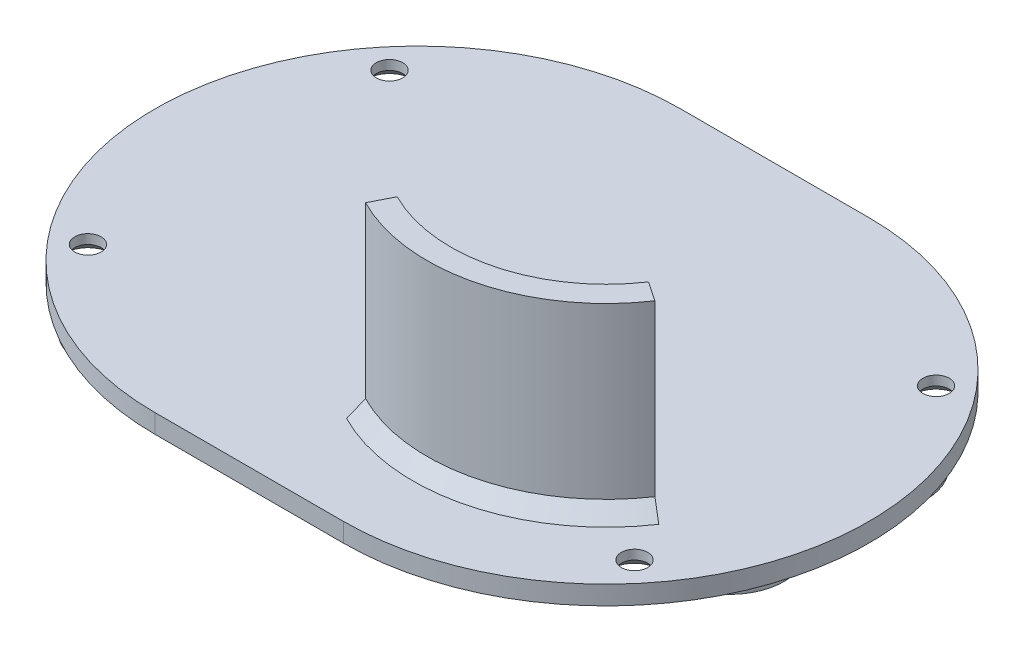
ISO-10303-21;
HEADER;
FILE_DESCRIPTION(('STEP AP214'),'2;1');
FILE_NAME('part.step','',(''),(''),'','','');
FILE_SCHEMA(('AUTOMOTIVE_DESIGN { 1 0 10303 214 1 1 1 1 }'));
ENDSEC;
DATA;
#1=APPLICATION_CONTEXT('core data for automotive mechanical design processes');
#2=APPLICATION_PROTOCOL_DEFINITION('international standard','automotive_design',2000,#1);
#3=PRODUCT_CONTEXT('',#1,'mechanical');
#4=PRODUCT('Part','Part','',(#3));
#5=PRODUCT_RELATED_PRODUCT_CATEGORY('part','',(#4));
#6=PRODUCT_DEFINITION_FORMATION('','',#4);
#7=PRODUCT_DEFINITION_CONTEXT('part definition',#1,'design');
#8=PRODUCT_DEFINITION('design','',#6,#7);
#9=PRODUCT_DEFINITION_SHAPE('','',#8);
#10=(LENGTH_UNIT() NAMED_UNIT(*) SI_UNIT(.MILLI.,.METRE.));
#11=(NAMED_UNIT(*) PLANE_ANGLE_UNIT() SI_UNIT($,.RADIAN.));
#12=(NAMED_UNIT(*) SI_UNIT($,.STERADIAN.) SOLID_ANGLE_UNIT());
#13=UNCERTAINTY_MEASURE_WITH_UNIT(LENGTH_MEASURE(1.E-05),#10,'distance_accuracy_value','');
#14=(GEOMETRIC_REPRESENTATION_CONTEXT(3) GLOBAL_UNCERTAINTY_ASSIGNED_CONTEXT((#13)) GLOBAL_UNIT_ASSIGNED_CONTEXT((#10,
#11,#12)) REPRESENTATION_CONTEXT('',''));
#15=CARTESIAN_POINT('',(0.,0.,0.));
#16=DIRECTION('',(0.,0.,1.));
#17=DIRECTION('',(1.,0.,0.));
#18=AXIS2_PLACEMENT_3D('',#15,#16,#17);
#19=CARTESIAN_POINT('',(0.,2.,0.));
#20=DIRECTION('',(0.,-1.,0.));
#21=DIRECTION('',(0.,0.,-1.));
#22=AXIS2_PLACEMENT_3D('',#19,#20,#21);
#23=PLANE('',#22);
#24=CARTESIAN_POINT('',(39.,2.,-16.));
#25=DIRECTION('',(0.,-1.,0.));
#26=DIRECTION('',(0.,0.,-1.));
#27=AXIS2_PLACEMENT_3D('',#24,#25,#26);
#28=CIRCLE('',#27,1.4);
#29=CARTESIAN_POINT('',(39.,2.,-17.4));
#30=VERTEX_POINT('',#29);
#31=EDGE_CURVE('E237',#30,#30,#28,.T.);
#32=ORIENTED_EDGE('',*,*,#31,.T.);
#33=EDGE_LOOP('',(#32));
#34=FACE_BOUND('',#33,.T.);
#35=CARTESIAN_POINT('',(39.,2.,16.));
#36=DIRECTION('',(0.,-1.,0.));
#37=DIRECTION('',(0.,0.,-1.));
#38=AXIS2_PLACEMENT_3D('',#35,#36,#37);
#39=CIRCLE('',#38,1.4);
#40=CARTESIAN_POINT('',(39.,2.,14.6));
#41=VERTEX_POINT('',#40);
#42=EDGE_CURVE('E232',#41,#41,#39,.T.);
#43=ORIENTED_EDGE('',*,*,#42,.T.);
#44=EDGE_LOOP('',(#43));
#45=FACE_BOUND('',#44,.T.);
#46=CARTESIAN_POINT('',(-19.,2.,16.));
#47=DIRECTION('',(0.,-1.,0.));
#48=DIRECTION('',(0.,0.,-1.));
#49=AXIS2_PLACEMENT_3D('',#46,#47,#48);
#50=CIRCLE('',#49,1.4);
#51=CARTESIAN_POINT('',(-19.,2.,14.6));
#52=VERTEX_POINT('',#51);
#53=EDGE_CURVE('E227',#52,#52,#50,.T.);
#54=ORIENTED_EDGE('',*,*,#53,.T.);
#55=EDGE_LOOP('',(#54));
#56=FACE_BOUND('',#55,.T.);
#57=CARTESIAN_POINT('',(-19.,2.,-16.));
#58=DIRECTION('',(0.,-1.,0.));
#59=DIRECTION('',(0.,0.,-1.));
#60=AXIS2_PLACEMENT_3D('',#57,#58,#59);
#61=CIRCLE('',#60,1.4);
#62=CARTESIAN_POINT('',(-19.,2.,-17.4));
#63=VERTEX_POINT('',#62);
#64=EDGE_CURVE('E171',#63,#63,#61,.T.);
#65=ORIENTED_EDGE('',*,*,#64,.T.);
#66=EDGE_LOOP('',(#65));
#67=FACE_BOUND('',#66,.T.);
#68=CARTESIAN_POINT('',(0.,2.,0.));
#69=DIRECTION('',(0.,-1.,0.));
#70=DIRECTION('',(0.,0.,-1.));
#71=AXIS2_PLACEMENT_3D('',#68,#69,#70);
#72=CIRCLE('',#71,27.9);
#73=CARTESIAN_POINT('',(0.,2.,27.9));
#74=VERTEX_POINT('',#73);
#75=CARTESIAN_POINT('',(0.,2.,-27.9));
#76=VERTEX_POINT('',#75);
#77=EDGE_CURVE('E157',#74,#76,#72,.T.);
#78=ORIENTED_EDGE('',*,*,#77,.F.);
#79=DIRECTION('',(-1.,0.,0.));
#80=VECTOR('',#79,1.);
#81=CARTESIAN_POINT('',(20.,2.,27.9));
#82=LINE('',#81,#80);
#83=CARTESIAN_POINT('',(20.,2.,27.9));
#84=VERTEX_POINT('',#83);
#85=EDGE_CURVE('E182',#84,#74,#82,.T.);
#86=ORIENTED_EDGE('',*,*,#85,.F.);
#87=CARTESIAN_POINT('',(20.,2.,0.));
#88=DIRECTION('',(0.,-1.,0.));
#89=DIRECTION('',(0.,0.,-1.));
#90=AXIS2_PLACEMENT_3D('',#87,#88,#89);
#91=CIRCLE('',#90,27.9);
#92=CARTESIAN_POINT('',(20.,2.,-27.9));
#93=VERTEX_POINT('',#92);
#94=EDGE_CURVE('E193',#93,#84,#91,.T.);
#95=ORIENTED_EDGE('',*,*,#94,.F.);
#96=DIRECTION('',(1.,0.,0.));
#97=VECTOR('',#96,1.);
#98=CARTESIAN_POINT('',(0.,2.,-27.9));
#99=LINE('',#98,#97);
#100=EDGE_CURVE('E191',#76,#93,#99,.T.);
#101=ORIENTED_EDGE('',*,*,#100,.F.);
#102=EDGE_LOOP('',(#78,#86,#95,#101));
#103=FACE_BOUND('',#102,.T.);
#104=CARTESIAN_POINT('',(20.,2.,0.));
#105=DIRECTION('',(0.,-1.,0.));
#106=DIRECTION('',(0.,0.,-1.));
#107=AXIS2_PLACEMENT_3D('',#104,#105,#106);
#108=CIRCLE('',#107,20.5);
#109=CARTESIAN_POINT('',(37.0125523501253,2.,11.4377909814023));
#110=VERTEX_POINT('',#109);
#111=CARTESIAN_POINT('',(10.7221709660309,2.,18.2803689354575));
#112=VERTEX_POINT('',#111);
#113=EDGE_CURVE('E210',#110,#112,#108,.T.);
#114=ORIENTED_EDGE('',*,*,#113,.T.);
#115=DIRECTION('',(0.452577026047278,0.,-0.891725313924754));
#116=VECTOR('',#115,1.);
#117=CARTESIAN_POINT('',(11.4010365051018,2.,16.9427809645704));
#118=LINE('',#117,#116);
#119=CARTESIAN_POINT('',(13.2113446092909,2.,13.3758797088713));
#120=VERTEX_POINT('',#119);
#121=EDGE_CURVE('E169',#112,#120,#118,.T.);
#122=ORIENTED_EDGE('',*,*,#121,.T.);
#123=CARTESIAN_POINT('',(20.,2.,0.));
#124=DIRECTION('',(0.,-1.,0.));
#125=DIRECTION('',(0.,0.,-1.));
#126=AXIS2_PLACEMENT_3D('',#123,#124,#125);
#127=CIRCLE('',#126,15.);
#128=CARTESIAN_POINT('',(32.448209036677,2.,8.36911535224557));
#129=VERTEX_POINT('',#128);
#130=EDGE_CURVE('E207',#120,#129,#127,.F.);
#131=ORIENTED_EDGE('',*,*,#130,.T.);
#132=DIRECTION('',(0.829880602445134,0.,0.557941023483039));
#133=VECTOR('',#132,1.);
#134=CARTESIAN_POINT('',(33.6930299403447,2.,9.20602688747011));
#135=LINE('',#134,#133);
#136=EDGE_CURVE('E150',#129,#110,#135,.T.);
#137=ORIENTED_EDGE('',*,*,#136,.T.);
#138=EDGE_LOOP('',(#114,#122,#131,#137));
#139=FACE_BOUND('',#138,.T.);
#140=ADVANCED_FACE('F59',(#34,#45,#56,#67,#103,#139),#23,.F.);
#141=CARTESIAN_POINT('',(0.,0.,0.));
#142=DIRECTION('',(0.,1.,0.));
#143=DIRECTION('',(0.,0.,1.));
#144=AXIS2_PLACEMENT_3D('',#141,#142,#143);
#145=CYLINDRICAL_SURFACE('',#144,27.9);
#146=ORIENTED_EDGE('',*,*,#77,.T.);
#147=DIRECTION('',(0.,1.,0.));
#148=VECTOR('',#147,1.);
#149=CARTESIAN_POINT('',(0.,0.,-27.9));
#150=LINE('',#149,#148);
#151=CARTESIAN_POINT('',(0.,0.,-27.9));
#152=VERTEX_POINT('',#151);
#153=EDGE_CURVE('E204',#152,#76,#150,.T.);
#154=ORIENTED_EDGE('',*,*,#153,.F.);
#155=CARTESIAN_POINT('',(0.,0.,0.));
#156=DIRECTION('',(0.,-1.,0.));
#157=DIRECTION('',(0.,0.,-1.));
#158=AXIS2_PLACEMENT_3D('',#155,#156,#157);
#159=CIRCLE('',#158,27.9);
#160=CARTESIAN_POINT('',(0.,0.,27.9));
#161=VERTEX_POINT('',#160);
#162=EDGE_CURVE('E178',#161,#152,#159,.T.);
#163=ORIENTED_EDGE('',*,*,#162,.F.);
#164=DIRECTION('',(0.,1.,0.));
#165=VECTOR('',#164,1.);
#166=CARTESIAN_POINT('',(0.,0.,27.9));
#167=LINE('',#166,#165);
#168=EDGE_CURVE('E188',#161,#74,#167,.T.);
#169=ORIENTED_EDGE('',*,*,#168,.T.);
#170=EDGE_LOOP('',(#146,#154,#163,#169));
#171=FACE_BOUND('',#170,.T.);
#172=ADVANCED_FACE('F279',(#171),#145,.T.);
#173=CARTESIAN_POINT('',(0.,0.,-27.9));
#174=DIRECTION('',(0.,0.,1.));
#175=DIRECTION('',(1.,0.,0.));
#176=AXIS2_PLACEMENT_3D('',#173,#174,#175);
#177=PLANE('',#176);
#178=ORIENTED_EDGE('',*,*,#100,.T.);
#179=DIRECTION('',(0.,1.,0.));
#180=VECTOR('',#179,1.);
#181=CARTESIAN_POINT('',(20.,0.,-27.9));
#182=LINE('',#181,#180);
#183=CARTESIAN_POINT('',(20.,0.,-27.9));
#184=VERTEX_POINT('',#183);
#185=EDGE_CURVE('E201',#184,#93,#182,.T.);
#186=ORIENTED_EDGE('',*,*,#185,.F.);
#187=DIRECTION('',(1.,0.,0.));
#188=VECTOR('',#187,1.);
#189=CARTESIAN_POINT('',(0.,0.,-27.9));
#190=LINE('',#189,#188);
#191=EDGE_CURVE('E181',#152,#184,#190,.T.);
#192=ORIENTED_EDGE('',*,*,#191,.F.);
#193=ORIENTED_EDGE('',*,*,#153,.T.);
#194=EDGE_LOOP('',(#178,#186,#192,#193));
#195=FACE_BOUND('',#194,.T.);
#196=ADVANCED_FACE('F284',(#195),#177,.F.);
#197=CARTESIAN_POINT('',(20.,0.,0.));
#198=DIRECTION('',(0.,1.,0.));
#199=DIRECTION('',(0.,0.,1.));
#200=AXIS2_PLACEMENT_3D('',#197,#198,#199);
#201=CYLINDRICAL_SURFACE('',#200,27.9);
#202=ORIENTED_EDGE('',*,*,#94,.T.);
#203=DIRECTION('',(0.,1.,0.));
#204=VECTOR('',#203,1.);
#205=CARTESIAN_POINT('',(20.,0.,27.9));
#206=LINE('',#205,#204);
#207=CARTESIAN_POINT('',(20.,0.,27.9));
#208=VERTEX_POINT('',#207);
#209=EDGE_CURVE('E198',#208,#84,#206,.T.);
#210=ORIENTED_EDGE('',*,*,#209,.F.);
#211=CARTESIAN_POINT('',(20.,0.,0.));
#212=DIRECTION('',(0.,-1.,0.));
#213=DIRECTION('',(0.,0.,-1.));
#214=AXIS2_PLACEMENT_3D('',#211,#212,#213);
#215=CIRCLE('',#214,27.9);
#216=EDGE_CURVE('E184',#184,#208,#215,.T.);
#217=ORIENTED_EDGE('',*,*,#216,.F.);
#218=ORIENTED_EDGE('',*,*,#185,.T.);
#219=EDGE_LOOP('',(#202,#210,#217,#218));
#220=FACE_BOUND('',#219,.T.);
#221=ADVANCED_FACE('F292',(#220),#201,.T.);
#222=CARTESIAN_POINT('',(20.,0.,27.9));
#223=DIRECTION('',(0.,0.,-1.));
#224=DIRECTION('',(-1.,0.,0.));
#225=AXIS2_PLACEMENT_3D('',#222,#223,#224);
#226=PLANE('',#225);
#227=ORIENTED_EDGE('',*,*,#85,.T.);
#228=ORIENTED_EDGE('',*,*,#168,.F.);
#229=DIRECTION('',(-1.,0.,0.));
#230=VECTOR('',#229,1.);
#231=CARTESIAN_POINT('',(20.,0.,27.9));
#232=LINE('',#231,#230);
#233=EDGE_CURVE('E186',#208,#161,#232,.T.);
#234=ORIENTED_EDGE('',*,*,#233,.F.);
#235=ORIENTED_EDGE('',*,*,#209,.T.);
#236=EDGE_LOOP('',(#227,#228,#234,#235));
#237=FACE_BOUND('',#236,.T.);
#238=ADVANCED_FACE('F289',(#237),#226,.F.);
#239=CARTESIAN_POINT('',(0.,0.,0.));
#240=DIRECTION('',(0.,-1.,0.));
#241=DIRECTION('',(0.,0.,-1.));
#242=AXIS2_PLACEMENT_3D('',#239,#240,#241);
#243=PLANE('',#242);
#244=CARTESIAN_POINT('',(40.67323765729,0.,-7.52444315316458));
#245=DIRECTION('',(0.,-1.,0.));
#246=DIRECTION('',(1.,0.,0.));
#247=AXIS2_PLACEMENT_3D('',#244,#245,#246);
#248=CIRCLE('',#247,5.75000000000001);
#249=CARTESIAN_POINT('',(46.42323765729,0.,-7.52444315316458));
#250=VERTEX_POINT('',#249);
#251=EDGE_CURVE('E456',#250,#250,#248,.T.);
#252=ORIENTED_EDGE('',*,*,#251,.F.);
#253=EDGE_LOOP('',(#252));
#254=FACE_BOUND('',#253,.T.);
#255=CARTESIAN_POINT('',(40.67323765729,0.,7.52444315316458));
#256=DIRECTION('',(0.,-1.,0.));
#257=DIRECTION('',(1.,0.,0.));
#258=AXIS2_PLACEMENT_3D('',#255,#256,#257);
#259=CIRCLE('',#258,5.75000000000001);
#260=CARTESIAN_POINT('',(46.42323765729,0.,7.52444315316458));
#261=VERTEX_POINT('',#260);
#262=EDGE_CURVE('E447',#261,#261,#259,.T.);
#263=ORIENTED_EDGE('',*,*,#262,.F.);
#264=EDGE_LOOP('',(#263));
#265=FACE_BOUND('',#264,.T.);
#266=CARTESIAN_POINT('',(-11.,0.,-19.0525588832577));
#267=DIRECTION('',(0.,-1.,0.));
#268=DIRECTION('',(1.,0.,0.));
#269=AXIS2_PLACEMENT_3D('',#266,#267,#268);
#270=CIRCLE('',#269,5.75);
#271=CARTESIAN_POINT('',(-5.24999999999995,0.,-19.0525588832577));
#272=VERTEX_POINT('',#271);
#273=EDGE_CURVE('E438',#272,#272,#270,.T.);
#274=ORIENTED_EDGE('',*,*,#273,.F.);
#275=EDGE_LOOP('',(#274));
#276=FACE_BOUND('',#275,.T.);
#277=CARTESIAN_POINT('',(-11.,0.,19.0525588832577));
#278=DIRECTION('',(0.,-1.,0.));
#279=DIRECTION('',(1.,0.,0.));
#280=AXIS2_PLACEMENT_3D('',#277,#278,#279);
#281=CIRCLE('',#280,5.75);
#282=CARTESIAN_POINT('',(-5.24999999999995,0.,19.0525588832577));
#283=VERTEX_POINT('',#282);
#284=EDGE_CURVE('E430',#283,#283,#281,.T.);
#285=ORIENTED_EDGE('',*,*,#284,.F.);
#286=EDGE_LOOP('',(#285));
#287=FACE_BOUND('',#286,.T.);
#288=CARTESIAN_POINT('',(39.,0.,-16.));
#289=DIRECTION('',(0.,-1.,0.));
#290=DIRECTION('',(0.,0.,-1.));
#291=AXIS2_PLACEMENT_3D('',#288,#289,#290);
#292=CIRCLE('',#291,2.4);
#293=CARTESIAN_POINT('',(39.,0.,-18.4));
#294=VERTEX_POINT('',#293);
#295=EDGE_CURVE('E426',#294,#294,#292,.T.);
#296=ORIENTED_EDGE('',*,*,#295,.F.);
#297=EDGE_LOOP('',(#296));
#298=FACE_BOUND('',#297,.T.);
#299=CARTESIAN_POINT('',(39.,0.,16.));
#300=DIRECTION('',(0.,-1.,0.));
#301=DIRECTION('',(0.,0.,-1.));
#302=AXIS2_PLACEMENT_3D('',#299,#300,#301);
#303=CIRCLE('',#302,2.4);
#304=CARTESIAN_POINT('',(39.,0.,13.6));
#305=VERTEX_POINT('',#304);
#306=EDGE_CURVE('E240',#305,#305,#303,.T.);
#307=ORIENTED_EDGE('',*,*,#306,.F.);
#308=EDGE_LOOP('',(#307));
#309=FACE_BOUND('',#308,.T.);
#310=CARTESIAN_POINT('',(-19.,0.,16.));
#311=DIRECTION('',(0.,-1.,0.));
#312=DIRECTION('',(0.,0.,-1.));
#313=AXIS2_PLACEMENT_3D('',#310,#311,#312);
#314=CIRCLE('',#313,2.4);
#315=CARTESIAN_POINT('',(-19.,0.,13.6));
#316=VERTEX_POINT('',#315);
#317=EDGE_CURVE('E235',#316,#316,#314,.T.);
#318=ORIENTED_EDGE('',*,*,#317,.F.);
#319=EDGE_LOOP('',(#318));
#320=FACE_BOUND('',#319,.T.);
#321=CARTESIAN_POINT('',(-19.,0.,-16.));
#322=DIRECTION('',(0.,-1.,0.));
#323=DIRECTION('',(0.,0.,-1.));
#324=AXIS2_PLACEMENT_3D('',#321,#322,#323);
#325=CIRCLE('',#324,2.4);
#326=CARTESIAN_POINT('',(-19.,0.,-18.4));
#327=VERTEX_POINT('',#326);
#328=EDGE_CURVE('E230',#327,#327,#325,.T.);
#329=ORIENTED_EDGE('',*,*,#328,.F.);
#330=EDGE_LOOP('',(#329));
#331=FACE_BOUND('',#330,.T.);
#332=ORIENTED_EDGE('',*,*,#162,.T.);
#333=ORIENTED_EDGE('',*,*,#191,.T.);
#334=ORIENTED_EDGE('',*,*,#216,.T.);
#335=ORIENTED_EDGE('',*,*,#233,.T.);
#336=EDGE_LOOP('',(#332,#333,#334,#335));
#337=FACE_BOUND('',#336,.T.);
#338=ADVANCED_FACE('F267',(#254,#265,#276,#287,#298,#309,#320,#331,#337),#243,.T.);
#339=CARTESIAN_POINT('',(20.,21.5,0.));
#340=DIRECTION('',(0.,-1.,0.));
#341=DIRECTION('',(0.,0.,-1.));
#342=AXIS2_PLACEMENT_3D('',#339,#340,#341);
#343=CYLINDRICAL_SURFACE('',#342,16.5);
#344=DIRECTION('',(0.,-1.,0.));
#345=VECTOR('',#344,1.);
#346=CARTESIAN_POINT('',(33.6930299403447,21.5,9.20602688747011));
#347=LINE('',#346,#345);
#348=CARTESIAN_POINT('',(33.6930299403447,21.5,9.20602688747011));
#349=VERTEX_POINT('',#348);
#350=CARTESIAN_POINT('',(33.6930299403447,3.50000000000001,9.20602688747011));
#351=VERTEX_POINT('',#350);
#352=EDGE_CURVE('E168',#349,#351,#347,.T.);
#353=ORIENTED_EDGE('',*,*,#352,.T.);
#354=CARTESIAN_POINT('',(20.,3.50000000000001,0.));
#355=DIRECTION('',(0.,-1.,0.));
#356=DIRECTION('',(0.,0.,-1.));
#357=AXIS2_PLACEMENT_3D('',#354,#355,#356);
#358=CIRCLE('',#357,16.5);
#359=CARTESIAN_POINT('',(12.53247907022,3.50000000000001,14.7134676797585));
#360=VERTEX_POINT('',#359);
#361=EDGE_CURVE('E155',#351,#360,#358,.T.);
#362=ORIENTED_EDGE('',*,*,#361,.T.);
#363=DIRECTION('',(0.,-1.,0.));
#364=VECTOR('',#363,1.);
#365=CARTESIAN_POINT('',(12.53247907022,21.5,14.7134676797585));
#366=LINE('',#365,#364);
#367=CARTESIAN_POINT('',(12.53247907022,21.5,14.7134676797585));
#368=VERTEX_POINT('',#367);
#369=EDGE_CURVE('E153',#368,#360,#366,.T.);
#370=ORIENTED_EDGE('',*,*,#369,.F.);
#371=CARTESIAN_POINT('',(20.,21.5,0.));
#372=DIRECTION('',(0.,-1.,0.));
#373=DIRECTION('',(0.,0.,-1.));
#374=AXIS2_PLACEMENT_3D('',#371,#372,#373);
#375=CIRCLE('',#374,16.5);
#376=EDGE_CURVE('E140',#349,#368,#375,.T.);
#377=ORIENTED_EDGE('',*,*,#376,.F.);
#378=EDGE_LOOP('',(#353,#362,#370,#377));
#379=FACE_BOUND('',#378,.T.);
#380=ADVANCED_FACE('F154',(#379),#343,.F.);
#381=CARTESIAN_POINT('',(11.4010365051018,21.5,16.9427809645704));
#382=DIRECTION('',(-0.891725313924754,0.,-0.452577026047278));
#383=DIRECTION('',(-0.452577026047278,0.,0.891725313924754));
#384=AXIS2_PLACEMENT_3D('',#381,#382,#383);
#385=PLANE('',#384);
#386=ORIENTED_EDGE('',*,*,#121,.F.);
#387=DIRECTION('',(0.320020284127271,0.707106781186547,-0.630545016431897));
#388=VECTOR('',#387,1.);
#389=CARTESIAN_POINT('',(20.,22.4999999999999,0.));
#390=LINE('',#389,#388);
#391=CARTESIAN_POINT('',(11.4010365051018,3.49999999999998,16.9427809645704));
#392=VERTEX_POINT('',#391);
#393=EDGE_CURVE('E216',#112,#392,#390,.T.);
#394=ORIENTED_EDGE('',*,*,#393,.T.);
#395=DIRECTION('',(0.,-1.,0.));
#396=VECTOR('',#395,1.);
#397=CARTESIAN_POINT('',(11.4010365051018,21.5,16.9427809645704));
#398=LINE('',#397,#396);
#399=CARTESIAN_POINT('',(11.4010365051018,21.5,16.9427809645704));
#400=VERTEX_POINT('',#399);
#401=EDGE_CURVE('E158',#400,#392,#398,.T.);
#402=ORIENTED_EDGE('',*,*,#401,.F.);
#403=DIRECTION('',(0.452577026047278,0.,-0.891725313924754));
#404=VECTOR('',#403,1.);
#405=CARTESIAN_POINT('',(11.4010365051018,21.5,16.9427809645704));
#406=LINE('',#405,#404);
#407=EDGE_CURVE('E145',#400,#368,#406,.T.);
#408=ORIENTED_EDGE('',*,*,#407,.T.);
#409=ORIENTED_EDGE('',*,*,#369,.T.);
#410=DIRECTION('',(-0.320020284127269,0.707106781186551,0.630545016431894));
#411=VECTOR('',#410,1.);
#412=CARTESIAN_POINT('',(20.,-13.0000000000002,0.));
#413=LINE('',#412,#411);
#414=EDGE_CURVE('E83',#360,#120,#413,.F.);
#415=ORIENTED_EDGE('',*,*,#414,.T.);
#416=EDGE_LOOP('',(#386,#394,#402,#408,#409,#415));
#417=FACE_BOUND('',#416,.T.);
#418=ADVANCED_FACE('F160',(#417),#385,.T.);
#419=CARTESIAN_POINT('',(20.,21.5,0.));
#420=DIRECTION('',(0.,-1.,0.));
#421=DIRECTION('',(0.,0.,-1.));
#422=AXIS2_PLACEMENT_3D('',#419,#420,#421);
#423=CYLINDRICAL_SURFACE('',#422,19.);
#424=ORIENTED_EDGE('',*,*,#401,.T.);
#425=CARTESIAN_POINT('',(20.,3.49999999999998,0.));
#426=DIRECTION('',(0.,-1.,0.));
#427=DIRECTION('',(0.,0.,-1.));
#428=AXIS2_PLACEMENT_3D('',#425,#426,#427);
#429=CIRCLE('',#428,19.);
#430=CARTESIAN_POINT('',(35.7677314464576,3.49999999999998,10.6008794461777));
#431=VERTEX_POINT('',#430);
#432=EDGE_CURVE('E213',#392,#431,#429,.F.);
#433=ORIENTED_EDGE('',*,*,#432,.T.);
#434=DIRECTION('',(0.,-1.,0.));
#435=VECTOR('',#434,1.);
#436=CARTESIAN_POINT('',(35.7677314464576,21.5,10.6008794461777));
#437=LINE('',#436,#435);
#438=CARTESIAN_POINT('',(35.7677314464576,21.5,10.6008794461777));
#439=VERTEX_POINT('',#438);
#440=EDGE_CURVE('E174',#439,#431,#437,.T.);
#441=ORIENTED_EDGE('',*,*,#440,.F.);
#442=CARTESIAN_POINT('',(20.,21.5,0.));
#443=DIRECTION('',(0.,1.,0.));
#444=DIRECTION('',(1.,0.,0.));
#445=AXIS2_PLACEMENT_3D('',#442,#443,#444);
#446=CIRCLE('',#445,19.);
#447=EDGE_CURVE('E162',#439,#400,#446,.F.);
#448=ORIENTED_EDGE('',*,*,#447,.T.);
#449=EDGE_LOOP('',(#424,#433,#441,#448));
#450=FACE_BOUND('',#449,.T.);
#451=ADVANCED_FACE('F317',(#450),#423,.T.);
#452=CARTESIAN_POINT('',(33.6930299403447,21.5,9.20602688747011));
#453=DIRECTION('',(0.557941023483039,0.,-0.829880602445135));
#454=DIRECTION('',(-0.829880602445135,0.,-0.557941023483039));
#455=AXIS2_PLACEMENT_3D('',#452,#453,#454);
#456=PLANE('',#455);
#457=ORIENTED_EDGE('',*,*,#136,.F.);
#458=DIRECTION('',(-0.586814201564129,-0.707106781186551,-0.394523881207018));
#459=VECTOR('',#458,1.);
#460=CARTESIAN_POINT('',(20.,-13.0000000000002,0.));
#461=LINE('',#460,#459);
#462=EDGE_CURVE('E75',#129,#351,#461,.F.);
#463=ORIENTED_EDGE('',*,*,#462,.T.);
#464=ORIENTED_EDGE('',*,*,#352,.F.);
#465=DIRECTION('',(0.829880602445134,0.,0.557941023483039));
#466=VECTOR('',#465,1.);
#467=CARTESIAN_POINT('',(33.6930299403447,21.5,9.20602688747011));
#468=LINE('',#467,#466);
#469=EDGE_CURVE('E148',#349,#439,#468,.T.);
#470=ORIENTED_EDGE('',*,*,#469,.T.);
#471=ORIENTED_EDGE('',*,*,#440,.T.);
#472=DIRECTION('',(0.586814201564133,-0.707106781186547,0.39452388120702));
#473=VECTOR('',#472,1.);
#474=CARTESIAN_POINT('',(20.,22.4999999999999,0.));
#475=LINE('',#474,#473);
#476=EDGE_CURVE('E218',#431,#110,#475,.T.);
#477=ORIENTED_EDGE('',*,*,#476,.T.);
#478=EDGE_LOOP('',(#457,#463,#464,#470,#471,#477));
#479=FACE_BOUND('',#478,.T.);
#480=ADVANCED_FACE('F310',(#479),#456,.T.);
#481=CARTESIAN_POINT('',(20.,21.5,0.));
#482=DIRECTION('',(0.,-1.,0.));
#483=DIRECTION('',(-1.,0.,0.));
#484=AXIS2_PLACEMENT_3D('',#481,#482,#483);
#485=PLANE('',#484);
#486=ORIENTED_EDGE('',*,*,#376,.T.);
#487=ORIENTED_EDGE('',*,*,#407,.F.);
#488=ORIENTED_EDGE('',*,*,#447,.F.);
#489=ORIENTED_EDGE('',*,*,#469,.F.);
#490=EDGE_LOOP('',(#486,#487,#488,#489));
#491=FACE_BOUND('',#490,.T.);
#492=ADVANCED_FACE('F142',(#491),#485,.F.);
#493=CARTESIAN_POINT('',(20.,2.,0.));
#494=DIRECTION('',(0.,-1.,0.));
#495=DIRECTION('',(0.,0.,-1.));
#496=AXIS2_PLACEMENT_3D('',#493,#494,#495);
#497=CONICAL_SURFACE('',#496,20.5,0.78539816339745);
#498=ORIENTED_EDGE('',*,*,#476,.F.);
#499=ORIENTED_EDGE('',*,*,#432,.F.);
#500=ORIENTED_EDGE('',*,*,#393,.F.);
#501=ORIENTED_EDGE('',*,*,#113,.F.);
#502=EDGE_LOOP('',(#498,#499,#500,#501));
#503=FACE_BOUND('',#502,.T.);
#504=ADVANCED_FACE('F300',(#503),#497,.T.);
#505=CARTESIAN_POINT('',(20.,3.50000000000001,0.));
#506=DIRECTION('',(0.,1.,0.));
#507=DIRECTION('',(0.,0.,1.));
#508=AXIS2_PLACEMENT_3D('',#505,#506,#507);
#509=CONICAL_SURFACE('',#508,16.5,0.785398163397443);
#510=ORIENTED_EDGE('',*,*,#462,.F.);
#511=ORIENTED_EDGE('',*,*,#130,.F.);
#512=ORIENTED_EDGE('',*,*,#414,.F.);
#513=ORIENTED_EDGE('',*,*,#361,.F.);
#514=EDGE_LOOP('',(#510,#511,#512,#513));
#515=FACE_BOUND('',#514,.T.);
#516=ADVANCED_FACE('F62',(#515),#509,.F.);
#517=CARTESIAN_POINT('',(-19.,0.,-16.));
#518=DIRECTION('',(0.,-1.,0.));
#519=DIRECTION('',(0.,0.,-1.));
#520=AXIS2_PLACEMENT_3D('',#517,#518,#519);
#521=CYLINDRICAL_SURFACE('',#520,1.4);
#522=CARTESIAN_POINT('',(-19.,1.,-16.));
#523=DIRECTION('',(0.,-1.,0.));
#524=DIRECTION('',(0.,0.,-1.));
#525=AXIS2_PLACEMENT_3D('',#522,#523,#524);
#526=CIRCLE('',#525,1.4);
#527=CARTESIAN_POINT('',(-19.,1.,-17.4));
#528=VERTEX_POINT('',#527);
#529=EDGE_CURVE('E226',#528,#528,#526,.T.);
#530=ORIENTED_EDGE('',*,*,#529,.T.);
#531=EDGE_LOOP('',(#530));
#532=FACE_BOUND('',#531,.T.);
#533=ORIENTED_EDGE('',*,*,#64,.F.);
#534=EDGE_LOOP('',(#533));
#535=FACE_BOUND('',#534,.T.);
#536=ADVANCED_FACE('F309',(#532,#535),#521,.F.);
#537=CARTESIAN_POINT('',(-19.,0.,-16.));
#538=DIRECTION('',(0.,-1.,0.));
#539=DIRECTION('',(0.,0.,-1.));
#540=AXIS2_PLACEMENT_3D('',#537,#538,#539);
#541=CONICAL_SURFACE('',#540,2.4,0.785398163397449);
#542=ORIENTED_EDGE('',*,*,#529,.F.);
#543=EDGE_LOOP('',(#542));
#544=FACE_BOUND('',#543,.T.);
#545=ORIENTED_EDGE('',*,*,#328,.T.);
#546=EDGE_LOOP('',(#545));
#547=FACE_BOUND('',#546,.T.);
#548=ADVANCED_FACE('F386',(#544,#547),#541,.F.);
#549=CARTESIAN_POINT('',(-19.,0.,16.));
#550=DIRECTION('',(0.,-1.,0.));
#551=DIRECTION('',(0.,0.,-1.));
#552=AXIS2_PLACEMENT_3D('',#549,#550,#551);
#553=CYLINDRICAL_SURFACE('',#552,1.4);
#554=CARTESIAN_POINT('',(-19.,1.,16.));
#555=DIRECTION('',(0.,-1.,0.));
#556=DIRECTION('',(0.,0.,-1.));
#557=AXIS2_PLACEMENT_3D('',#554,#555,#556);
#558=CIRCLE('',#557,1.4);
#559=CARTESIAN_POINT('',(-19.,1.,14.6));
#560=VERTEX_POINT('',#559);
#561=EDGE_CURVE('E231',#560,#560,#558,.T.);
#562=ORIENTED_EDGE('',*,*,#561,.T.);
#563=EDGE_LOOP('',(#562));
#564=FACE_BOUND('',#563,.T.);
#565=ORIENTED_EDGE('',*,*,#53,.F.);
#566=EDGE_LOOP('',(#565));
#567=FACE_BOUND('',#566,.T.);
#568=ADVANCED_FACE('F382',(#564,#567),#553,.F.);
#569=CARTESIAN_POINT('',(-19.,0.,16.));
#570=DIRECTION('',(0.,-1.,0.));
#571=DIRECTION('',(0.,0.,-1.));
#572=AXIS2_PLACEMENT_3D('',#569,#570,#571);
#573=CONICAL_SURFACE('',#572,2.4,0.785398163397449);
#574=ORIENTED_EDGE('',*,*,#561,.F.);
#575=EDGE_LOOP('',(#574));
#576=FACE_BOUND('',#575,.T.);
#577=ORIENTED_EDGE('',*,*,#317,.T.);
#578=EDGE_LOOP('',(#577));
#579=FACE_BOUND('',#578,.T.);
#580=ADVANCED_FACE('F378',(#576,#579),#573,.F.);
#581=CARTESIAN_POINT('',(39.,0.,16.));
#582=DIRECTION('',(0.,-1.,0.));
#583=DIRECTION('',(0.,0.,-1.));
#584=AXIS2_PLACEMENT_3D('',#581,#582,#583);
#585=CYLINDRICAL_SURFACE('',#584,1.4);
#586=CARTESIAN_POINT('',(39.,1.,16.));
#587=DIRECTION('',(0.,-1.,0.));
#588=DIRECTION('',(0.,0.,-1.));
#589=AXIS2_PLACEMENT_3D('',#586,#587,#588);
#590=CIRCLE('',#589,1.4);
#591=CARTESIAN_POINT('',(39.,1.,14.6));
#592=VERTEX_POINT('',#591);
#593=EDGE_CURVE('E236',#592,#592,#590,.T.);
#594=ORIENTED_EDGE('',*,*,#593,.T.);
#595=EDGE_LOOP('',(#594));
#596=FACE_BOUND('',#595,.T.);
#597=ORIENTED_EDGE('',*,*,#42,.F.);
#598=EDGE_LOOP('',(#597));
#599=FACE_BOUND('',#598,.T.);
#600=ADVANCED_FACE('F374',(#596,#599),#585,.F.);
#601=CARTESIAN_POINT('',(39.,0.,16.));
#602=DIRECTION('',(0.,-1.,0.));
#603=DIRECTION('',(0.,0.,-1.));
#604=AXIS2_PLACEMENT_3D('',#601,#602,#603);
#605=CONICAL_SURFACE('',#604,2.4,0.785398163397449);
#606=ORIENTED_EDGE('',*,*,#593,.F.);
#607=EDGE_LOOP('',(#606));
#608=FACE_BOUND('',#607,.T.);
#609=ORIENTED_EDGE('',*,*,#306,.T.);
#610=EDGE_LOOP('',(#609));
#611=FACE_BOUND('',#610,.T.);
#612=ADVANCED_FACE('F370',(#608,#611),#605,.F.);
#613=CARTESIAN_POINT('',(39.,0.,-16.));
#614=DIRECTION('',(0.,-1.,0.));
#615=DIRECTION('',(0.,0.,-1.));
#616=AXIS2_PLACEMENT_3D('',#613,#614,#615);
#617=CYLINDRICAL_SURFACE('',#616,1.4);
#618=CARTESIAN_POINT('',(39.,1.,-16.));
#619=DIRECTION('',(0.,-1.,0.));
#620=DIRECTION('',(0.,0.,-1.));
#621=AXIS2_PLACEMENT_3D('',#618,#619,#620);
#622=CIRCLE('',#621,1.4);
#623=CARTESIAN_POINT('',(39.,1.,-17.4));
#624=VERTEX_POINT('',#623);
#625=EDGE_CURVE('E241',#624,#624,#622,.T.);
#626=ORIENTED_EDGE('',*,*,#625,.T.);
#627=EDGE_LOOP('',(#626));
#628=FACE_BOUND('',#627,.T.);
#629=ORIENTED_EDGE('',*,*,#31,.F.);
#630=EDGE_LOOP('',(#629));
#631=FACE_BOUND('',#630,.T.);
#632=ADVANCED_FACE('F366',(#628,#631),#617,.F.);
#633=CARTESIAN_POINT('',(39.,0.,-16.));
#634=DIRECTION('',(0.,-1.,0.));
#635=DIRECTION('',(0.,0.,-1.));
#636=AXIS2_PLACEMENT_3D('',#633,#634,#635);
#637=CONICAL_SURFACE('',#636,2.4,0.785398163397449);
#638=ORIENTED_EDGE('',*,*,#625,.F.);
#639=EDGE_LOOP('',(#638));
#640=FACE_BOUND('',#639,.T.);
#641=ORIENTED_EDGE('',*,*,#295,.T.);
#642=EDGE_LOOP('',(#641));
#643=FACE_BOUND('',#642,.T.);
#644=ADVANCED_FACE('F361',(#640,#643),#637,.F.);
#645=CARTESIAN_POINT('',(-11.,-0.5,19.0525588832577));
#646=DIRECTION('',(0.,-1.,0.));
#647=DIRECTION('',(0.,0.,-1.));
#648=AXIS2_PLACEMENT_3D('',#645,#646,#647);
#649=PLANE('',#648);
#650=CARTESIAN_POINT('',(-11.,-0.5,19.0525588832577));
#651=DIRECTION('',(0.,-1.,0.));
#652=DIRECTION('',(1.,0.,0.));
#653=AXIS2_PLACEMENT_3D('',#650,#651,#652);
#654=CIRCLE('',#653,5.75);
#655=CARTESIAN_POINT('',(-5.24999999999995,-0.5,19.0525588832577));
#656=VERTEX_POINT('',#655);
#657=EDGE_CURVE('E429',#656,#656,#654,.T.);
#658=ORIENTED_EDGE('',*,*,#657,.T.);
#659=EDGE_LOOP('',(#658));
#660=FACE_BOUND('',#659,.T.);
#661=CARTESIAN_POINT('',(-11.,-0.5,19.0525588832577));
#662=DIRECTION('',(0.,-1.,0.));
#663=DIRECTION('',(0.,0.,-1.));
#664=AXIS2_PLACEMENT_3D('',#661,#662,#663);
#665=CIRCLE('',#664,4.25);
#666=CARTESIAN_POINT('',(-11.,-0.5,14.8025588832577));
#667=VERTEX_POINT('',#666);
#668=EDGE_CURVE('E433',#667,#667,#665,.T.);
#669=ORIENTED_EDGE('',*,*,#668,.F.);
#670=EDGE_LOOP('',(#669));
#671=FACE_BOUND('',#670,.T.);
#672=ADVANCED_FACE('F354',(#660,#671),#649,.T.);
#673=CARTESIAN_POINT('',(-11.,-0.5,19.0525588832577));
#674=DIRECTION('',(0.,1.,0.));
#675=DIRECTION('',(0.,0.,1.));
#676=AXIS2_PLACEMENT_3D('',#673,#674,#675);
#677=CYLINDRICAL_SURFACE('',#676,5.75);
#678=ORIENTED_EDGE('',*,*,#657,.F.);
#679=EDGE_LOOP('',(#678));
#680=FACE_BOUND('',#679,.T.);
#681=ORIENTED_EDGE('',*,*,#284,.T.);
#682=EDGE_LOOP('',(#681));
#683=FACE_BOUND('',#682,.T.);
#684=ADVANCED_FACE('F346',(#680,#683),#677,.T.);
#685=CARTESIAN_POINT('',(-11.,-0.5,19.0525588832577));
#686=DIRECTION('',(0.,1.,0.));
#687=DIRECTION('',(0.,0.,1.));
#688=AXIS2_PLACEMENT_3D('',#685,#686,#687);
#689=CYLINDRICAL_SURFACE('',#688,4.25);
#690=ORIENTED_EDGE('',*,*,#668,.T.);
#691=EDGE_LOOP('',(#690));
#692=FACE_BOUND('',#691,.T.);
#693=CARTESIAN_POINT('',(-11.,0.,19.0525588832577));
#694=DIRECTION('',(0.,-1.,0.));
#695=DIRECTION('',(0.,0.,-1.));
#696=AXIS2_PLACEMENT_3D('',#693,#694,#695);
#697=CIRCLE('',#696,4.25);
#698=CARTESIAN_POINT('',(-11.,0.,14.8025588832577));
#699=VERTEX_POINT('',#698);
#700=EDGE_CURVE('E223',#699,#699,#697,.F.);
#701=ORIENTED_EDGE('',*,*,#700,.T.);
#702=EDGE_LOOP('',(#701));
#703=FACE_BOUND('',#702,.T.);
#704=ADVANCED_FACE('F337',(#692,#703),#689,.F.);
#705=ORIENTED_EDGE('',*,*,#700,.F.);
#706=EDGE_LOOP('',(#705));
#707=FACE_BOUND('',#706,.T.);
#708=ADVANCED_FACE('F274',(#707),#243,.T.);
#709=CARTESIAN_POINT('',(-11.,-0.5,-19.0525588832577));
#710=DIRECTION('',(0.,-1.,0.));
#711=DIRECTION('',(0.,0.,-1.));
#712=AXIS2_PLACEMENT_3D('',#709,#710,#711);
#713=PLANE('',#712);
#714=CARTESIAN_POINT('',(-11.,-0.5,-19.0525588832577));
#715=DIRECTION('',(0.,-1.,0.));
#716=DIRECTION('',(1.,0.,0.));
#717=AXIS2_PLACEMENT_3D('',#714,#715,#716);
#718=CIRCLE('',#717,5.75);
#719=CARTESIAN_POINT('',(-5.24999999999995,-0.5,-19.0525588832577));
#720=VERTEX_POINT('',#719);
#721=EDGE_CURVE('E437',#720,#720,#718,.T.);
#722=ORIENTED_EDGE('',*,*,#721,.T.);
#723=EDGE_LOOP('',(#722));
#724=FACE_BOUND('',#723,.T.);
#725=CARTESIAN_POINT('',(-11.,-0.5,-19.0525588832577));
#726=DIRECTION('',(0.,-1.,0.));
#727=DIRECTION('',(0.,0.,-1.));
#728=AXIS2_PLACEMENT_3D('',#725,#726,#727);
#729=CIRCLE('',#728,4.25);
#730=CARTESIAN_POINT('',(-11.,-0.5,-23.3025588832577));
#731=VERTEX_POINT('',#730);
#732=EDGE_CURVE('E441',#731,#731,#729,.T.);
#733=ORIENTED_EDGE('',*,*,#732,.F.);
#734=EDGE_LOOP('',(#733));
#735=FACE_BOUND('',#734,.T.);
#736=ADVANCED_FACE('F336',(#724,#735),#713,.T.);
#737=CARTESIAN_POINT('',(-11.,-0.5,-19.0525588832577));
#738=DIRECTION('',(0.,1.,0.));
#739=DIRECTION('',(0.,0.,1.));
#740=AXIS2_PLACEMENT_3D('',#737,#738,#739);
#741=CYLINDRICAL_SURFACE('',#740,5.75);
#742=ORIENTED_EDGE('',*,*,#721,.F.);
#743=EDGE_LOOP('',(#742));
#744=FACE_BOUND('',#743,.T.);
#745=ORIENTED_EDGE('',*,*,#273,.T.);
#746=EDGE_LOOP('',(#745));
#747=FACE_BOUND('',#746,.T.);
#748=ADVANCED_FACE('F343',(#744,#747),#741,.T.);
#749=CARTESIAN_POINT('',(-11.,-0.5,-19.0525588832577));
#750=DIRECTION('',(0.,1.,0.));
#751=DIRECTION('',(0.,0.,1.));
#752=AXIS2_PLACEMENT_3D('',#749,#750,#751);
#753=CYLINDRICAL_SURFACE('',#752,4.25);
#754=ORIENTED_EDGE('',*,*,#732,.T.);
#755=EDGE_LOOP('',(#754));
#756=FACE_BOUND('',#755,.T.);
#757=CARTESIAN_POINT('',(-11.,0.,-19.0525588832577));
#758=DIRECTION('',(0.,-1.,0.));
#759=DIRECTION('',(0.,0.,-1.));
#760=AXIS2_PLACEMENT_3D('',#757,#758,#759);
#761=CIRCLE('',#760,4.25);
#762=CARTESIAN_POINT('',(-11.,0.,-23.3025588832577));
#763=VERTEX_POINT('',#762);
#764=EDGE_CURVE('E244',#763,#763,#761,.F.);
#765=ORIENTED_EDGE('',*,*,#764,.T.);
#766=EDGE_LOOP('',(#765));
#767=FACE_BOUND('',#766,.T.);
#768=ADVANCED_FACE('F272',(#756,#767),#753,.F.);
#769=ORIENTED_EDGE('',*,*,#764,.F.);
#770=EDGE_LOOP('',(#769));
#771=FACE_BOUND('',#770,.T.);
#772=ADVANCED_FACE('F255',(#771),#243,.T.);
#773=CARTESIAN_POINT('',(40.67323765729,-0.5,7.52444315316458));
#774=DIRECTION('',(0.,-1.,0.));
#775=DIRECTION('',(0.,0.,-1.));
#776=AXIS2_PLACEMENT_3D('',#773,#774,#775);
#777=PLANE('',#776);
#778=CARTESIAN_POINT('',(40.67323765729,-0.5,7.52444315316458));
#779=DIRECTION('',(0.,-1.,0.));
#780=DIRECTION('',(1.,0.,0.));
#781=AXIS2_PLACEMENT_3D('',#778,#779,#780);
#782=CIRCLE('',#781,5.75000000000001);
#783=CARTESIAN_POINT('',(46.42323765729,-0.5,7.52444315316458));
#784=VERTEX_POINT('',#783);
#785=EDGE_CURVE('E446',#784,#784,#782,.T.);
#786=ORIENTED_EDGE('',*,*,#785,.T.);
#787=EDGE_LOOP('',(#786));
#788=FACE_BOUND('',#787,.T.);
#789=CARTESIAN_POINT('',(40.67323765729,-0.5,7.52444315316458));
#790=DIRECTION('',(0.,-1.,0.));
#791=DIRECTION('',(0.,0.,-1.));
#792=AXIS2_PLACEMENT_3D('',#789,#790,#791);
#793=CIRCLE('',#792,4.25000000000001);
#794=CARTESIAN_POINT('',(40.67323765729,-0.5,3.27444315316458));
#795=VERTEX_POINT('',#794);
#796=EDGE_CURVE('E450',#795,#795,#793,.T.);
#797=ORIENTED_EDGE('',*,*,#796,.F.);
#798=EDGE_LOOP('',(#797));
#799=FACE_BOUND('',#798,.T.);
#800=ADVANCED_FACE('F271',(#788,#799),#777,.T.);
#801=CARTESIAN_POINT('',(40.67323765729,-0.5,7.52444315316458));
#802=DIRECTION('',(0.,1.,0.));
#803=DIRECTION('',(0.,0.,1.));
#804=AXIS2_PLACEMENT_3D('',#801,#802,#803);
#805=CYLINDRICAL_SURFACE('',#804,5.75000000000001);
#806=ORIENTED_EDGE('',*,*,#785,.F.);
#807=EDGE_LOOP('',(#806));
#808=FACE_BOUND('',#807,.T.);
#809=ORIENTED_EDGE('',*,*,#262,.T.);
#810=EDGE_LOOP('',(#809));
#811=FACE_BOUND('',#810,.T.);
#812=ADVANCED_FACE('F264',(#808,#811),#805,.T.);
#813=CARTESIAN_POINT('',(40.67323765729,-0.5,7.52444315316458));
#814=DIRECTION('',(0.,1.,0.));
#815=DIRECTION('',(0.,0.,1.));
#816=AXIS2_PLACEMENT_3D('',#813,#814,#815);
#817=CYLINDRICAL_SURFACE('',#816,4.25000000000001);
#818=ORIENTED_EDGE('',*,*,#796,.T.);
#819=EDGE_LOOP('',(#818));
#820=FACE_BOUND('',#819,.T.);
#821=CARTESIAN_POINT('',(40.67323765729,0.,7.52444315316458));
#822=DIRECTION('',(0.,-1.,0.));
#823=DIRECTION('',(0.,0.,-1.));
#824=AXIS2_PLACEMENT_3D('',#821,#822,#823);
#825=CIRCLE('',#824,4.25000000000001);
#826=CARTESIAN_POINT('',(40.67323765729,0.,3.27444315316458));
#827=VERTEX_POINT('',#826);
#828=EDGE_CURVE('E68',#827,#827,#825,.F.);
#829=ORIENTED_EDGE('',*,*,#828,.T.);
#830=EDGE_LOOP('',(#829));
#831=FACE_BOUND('',#830,.T.);
#832=ADVANCED_FACE('F249',(#820,#831),#817,.F.);
#833=ORIENTED_EDGE('',*,*,#828,.F.);
#834=EDGE_LOOP('',(#833));
#835=FACE_BOUND('',#834,.T.);
#836=ADVANCED_FACE('F251',(#835),#243,.T.);
#837=CARTESIAN_POINT('',(40.67323765729,-0.5,-7.52444315316458));
#838=DIRECTION('',(0.,-1.,0.));
#839=DIRECTION('',(0.,0.,-1.));
#840=AXIS2_PLACEMENT_3D('',#837,#838,#839);
#841=PLANE('',#840);
#842=CARTESIAN_POINT('',(40.67323765729,-0.5,-7.52444315316458));
#843=DIRECTION('',(0.,-1.,0.));
#844=DIRECTION('',(1.,0.,0.));
#845=AXIS2_PLACEMENT_3D('',#842,#843,#844);
#846=CIRCLE('',#845,5.75000000000001);
#847=CARTESIAN_POINT('',(46.42323765729,-0.5,-7.52444315316458));
#848=VERTEX_POINT('',#847);
#849=EDGE_CURVE('E455',#848,#848,#846,.T.);
#850=ORIENTED_EDGE('',*,*,#849,.T.);
#851=EDGE_LOOP('',(#850));
#852=FACE_BOUND('',#851,.T.);
#853=CARTESIAN_POINT('',(40.67323765729,-0.5,-7.52444315316458));
#854=DIRECTION('',(0.,-1.,0.));
#855=DIRECTION('',(0.,0.,-1.));
#856=AXIS2_PLACEMENT_3D('',#853,#854,#855);
#857=CIRCLE('',#856,4.25000000000001);
#858=CARTESIAN_POINT('',(40.67323765729,-0.5,-11.7744431531646));
#859=VERTEX_POINT('',#858);
#860=EDGE_CURVE('E459',#859,#859,#857,.T.);
#861=ORIENTED_EDGE('',*,*,#860,.F.);
#862=EDGE_LOOP('',(#861));
#863=FACE_BOUND('',#862,.T.);
#864=ADVANCED_FACE('F253',(#852,#863),#841,.T.);
#865=CARTESIAN_POINT('',(40.67323765729,-0.5,-7.52444315316458));
#866=DIRECTION('',(0.,1.,0.));
#867=DIRECTION('',(0.,0.,1.));
#868=AXIS2_PLACEMENT_3D('',#865,#866,#867);
#869=CYLINDRICAL_SURFACE('',#868,5.75000000000001);
#870=ORIENTED_EDGE('',*,*,#849,.F.);
#871=EDGE_LOOP('',(#870));
#872=FACE_BOUND('',#871,.T.);
#873=ORIENTED_EDGE('',*,*,#251,.T.);
#874=EDGE_LOOP('',(#873));
#875=FACE_BOUND('',#874,.T.);
#876=ADVANCED_FACE('F261',(#872,#875),#869,.T.);
#877=CARTESIAN_POINT('',(40.67323765729,-0.5,-7.52444315316458));
#878=DIRECTION('',(0.,1.,0.));
#879=DIRECTION('',(0.,0.,1.));
#880=AXIS2_PLACEMENT_3D('',#877,#878,#879);
#881=CYLINDRICAL_SURFACE('',#880,4.25000000000001);
#882=ORIENTED_EDGE('',*,*,#860,.T.);
#883=EDGE_LOOP('',(#882));
#884=FACE_BOUND('',#883,.T.);
#885=CARTESIAN_POINT('',(40.67323765729,0.,-7.52444315316458));
#886=DIRECTION('',(0.,-1.,0.));
#887=DIRECTION('',(0.,0.,-1.));
#888=AXIS2_PLACEMENT_3D('',#885,#886,#887);
#889=CIRCLE('',#888,4.25000000000001);
#890=CARTESIAN_POINT('',(40.67323765729,0.,-11.7744431531646));
#891=VERTEX_POINT('',#890);
#892=EDGE_CURVE('E12',#891,#891,#889,.F.);
#893=ORIENTED_EDGE('',*,*,#892,.T.);
#894=EDGE_LOOP('',(#893));
#895=FACE_BOUND('',#894,.T.);
#896=ADVANCED_FACE('F276',(#884,#895),#881,.F.);
#897=ORIENTED_EDGE('',*,*,#892,.F.);
#898=EDGE_LOOP('',(#897));
#899=FACE_BOUND('',#898,.T.);
#900=ADVANCED_FACE('F256',(#899),#243,.T.);
#901=CLOSED_SHELL('',(#140,#172,#196,#221,#238,#338,#380,#418,#451,#480,#492,#504,#516,#536,
#548,#568,#580,#600,#612,#632,#644,#672,#684,#704,#708,#736,#748,#768,#772,#800,#812,#832,#836,
#864,#876,#896,#900));
#902=MANIFOLD_SOLID_BREP('B2',#901);
#903=ADVANCED_BREP_SHAPE_REPRESENTATION('',(#18,#902),#14);
#904=SHAPE_DEFINITION_REPRESENTATION(#9,#903);
ENDSEC;
END-ISO-10303-21;
